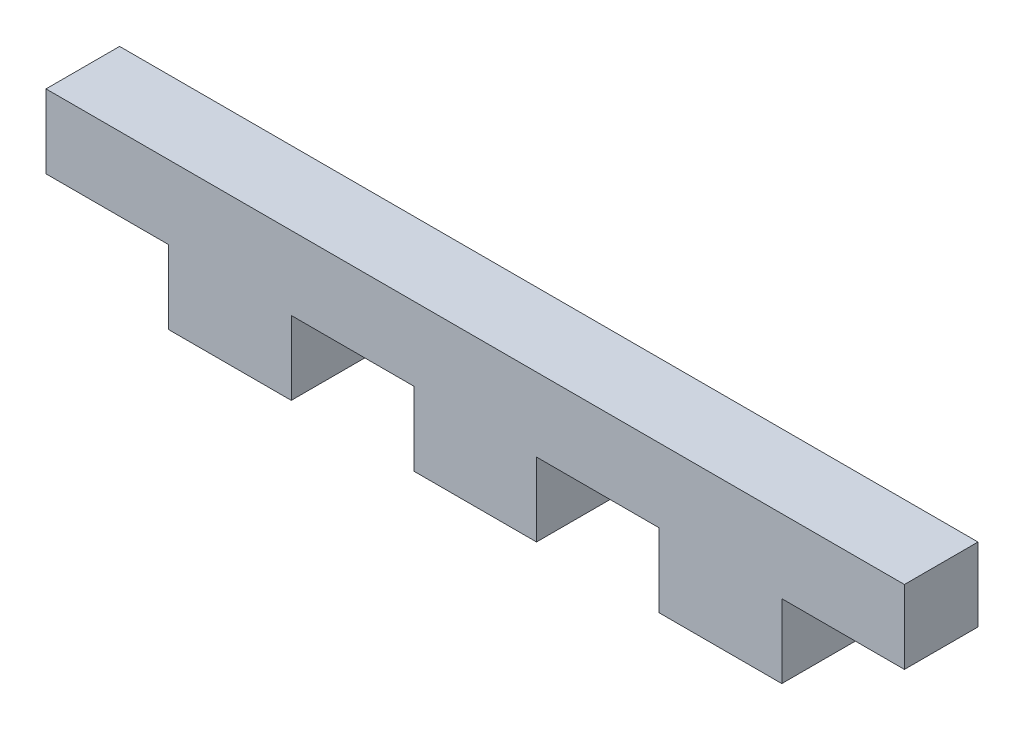
ISO-10303-21;
HEADER;
FILE_DESCRIPTION(('STEP AP214'),'2;1');
FILE_NAME('part.step','',(''),(''),'','','');
FILE_SCHEMA(('AUTOMOTIVE_DESIGN { 1 0 10303 214 1 1 1 1 }'));
ENDSEC;
DATA;
#1=APPLICATION_CONTEXT('core data for automotive mechanical design processes');
#2=APPLICATION_PROTOCOL_DEFINITION('international standard','automotive_design',2000,#1);
#3=PRODUCT_CONTEXT('',#1,'mechanical');
#4=PRODUCT('Part','Part','',(#3));
#5=PRODUCT_RELATED_PRODUCT_CATEGORY('part','',(#4));
#6=PRODUCT_DEFINITION_FORMATION('','',#4);
#7=PRODUCT_DEFINITION_CONTEXT('part definition',#1,'design');
#8=PRODUCT_DEFINITION('design','',#6,#7);
#9=PRODUCT_DEFINITION_SHAPE('','',#8);
#10=(LENGTH_UNIT() NAMED_UNIT(*) SI_UNIT(.MILLI.,.METRE.));
#11=(NAMED_UNIT(*) PLANE_ANGLE_UNIT() SI_UNIT($,.RADIAN.));
#12=(NAMED_UNIT(*) SI_UNIT($,.STERADIAN.) SOLID_ANGLE_UNIT());
#13=UNCERTAINTY_MEASURE_WITH_UNIT(LENGTH_MEASURE(1.E-05),#10,'distance_accuracy_value','');
#14=(GEOMETRIC_REPRESENTATION_CONTEXT(3) GLOBAL_UNCERTAINTY_ASSIGNED_CONTEXT((#13)) GLOBAL_UNIT_ASSIGNED_CONTEXT((#10,
#11,#12)) REPRESENTATION_CONTEXT('',''));
#15=CARTESIAN_POINT('',(0.,0.,0.));
#16=DIRECTION('',(0.,0.,1.));
#17=DIRECTION('',(1.,0.,0.));
#18=AXIS2_PLACEMENT_3D('',#15,#16,#17);
#19=CARTESIAN_POINT('',(8.99010664219347,0.,3.));
#20=DIRECTION('',(1.,0.,0.));
#21=DIRECTION('',(0.,1.,0.));
#22=AXIS2_PLACEMENT_3D('',#19,#20,#21);
#23=PLANE('',#22);
#24=DIRECTION('',(0.,-1.,0.));
#25=VECTOR('',#24,1.);
#26=CARTESIAN_POINT('',(8.99010664219347,0.,0.));
#27=LINE('',#26,#25);
#28=CARTESIAN_POINT('',(8.99010664219347,0.100430327009229,0.));
#29=VERTEX_POINT('',#28);
#30=CARTESIAN_POINT('',(8.99010664219347,-2.89956967299077,0.));
#31=VERTEX_POINT('',#30);
#32=EDGE_CURVE('E208',#29,#31,#27,.T.);
#33=ORIENTED_EDGE('',*,*,#32,.F.);
#34=DIRECTION('',(0.,0.,-1.));
#35=VECTOR('',#34,1.);
#36=CARTESIAN_POINT('',(8.99010664219347,0.100430327009229,3.));
#37=LINE('',#36,#35);
#38=CARTESIAN_POINT('',(8.99010664219347,0.100430327009229,3.));
#39=VERTEX_POINT('',#38);
#40=EDGE_CURVE('E11',#39,#29,#37,.T.);
#41=ORIENTED_EDGE('',*,*,#40,.F.);
#42=DIRECTION('',(0.,-1.,0.));
#43=VECTOR('',#42,1.);
#44=CARTESIAN_POINT('',(8.99010664219347,0.,3.));
#45=LINE('',#44,#43);
#46=CARTESIAN_POINT('',(8.99010664219347,-2.89956967299077,3.));
#47=VERTEX_POINT('',#46);
#48=EDGE_CURVE('E183',#39,#47,#45,.T.);
#49=ORIENTED_EDGE('',*,*,#48,.T.);
#50=DIRECTION('',(0.,0.,-1.));
#51=VECTOR('',#50,1.);
#52=CARTESIAN_POINT('',(8.99010664219347,-2.89956967299077,3.));
#53=LINE('',#52,#51);
#54=EDGE_CURVE('E109',#47,#31,#53,.T.);
#55=ORIENTED_EDGE('',*,*,#54,.T.);
#56=EDGE_LOOP('',(#33,#41,#49,#55));
#57=FACE_BOUND('',#56,.T.);
#58=ADVANCED_FACE('F35',(#57),#23,.T.);
#59=CARTESIAN_POINT('',(0.,0.10043032700923,3.));
#60=DIRECTION('',(0.,-1.,0.));
#61=DIRECTION('',(1.,0.,0.));
#62=AXIS2_PLACEMENT_3D('',#59,#60,#61);
#63=PLANE('',#62);
#64=DIRECTION('',(-1.,0.,0.));
#65=VECTOR('',#64,1.);
#66=CARTESIAN_POINT('',(0.,0.10043032700923,0.));
#67=LINE('',#66,#65);
#68=CARTESIAN_POINT('',(13.9901066421935,0.100430327009228,0.));
#69=VERTEX_POINT('',#68);
#70=EDGE_CURVE('E211',#69,#29,#67,.T.);
#71=ORIENTED_EDGE('',*,*,#70,.F.);
#72=DIRECTION('',(0.,0.,-1.));
#73=VECTOR('',#72,1.);
#74=CARTESIAN_POINT('',(13.9901066421935,0.100430327009228,3.));
#75=LINE('',#74,#73);
#76=CARTESIAN_POINT('',(13.9901066421935,0.100430327009228,3.));
#77=VERTEX_POINT('',#76);
#78=EDGE_CURVE('E43',#77,#69,#75,.T.);
#79=ORIENTED_EDGE('',*,*,#78,.F.);
#80=DIRECTION('',(-1.,0.,0.));
#81=VECTOR('',#80,1.);
#82=CARTESIAN_POINT('',(0.,0.10043032700923,3.));
#83=LINE('',#82,#81);
#84=EDGE_CURVE('E172',#77,#39,#83,.T.);
#85=ORIENTED_EDGE('',*,*,#84,.T.);
#86=ORIENTED_EDGE('',*,*,#40,.T.);
#87=EDGE_LOOP('',(#71,#79,#85,#86));
#88=FACE_BOUND('',#87,.T.);
#89=ADVANCED_FACE('F276',(#88),#63,.T.);
#90=CARTESIAN_POINT('',(13.9901066421935,0.,3.));
#91=DIRECTION('',(1.,0.,0.));
#92=DIRECTION('',(0.,0.,-1.));
#93=AXIS2_PLACEMENT_3D('',#90,#91,#92);
#94=PLANE('',#93);
#95=DIRECTION('',(0.,-1.,0.));
#96=VECTOR('',#95,1.);
#97=CARTESIAN_POINT('',(13.9901066421935,0.,0.));
#98=LINE('',#97,#96);
#99=CARTESIAN_POINT('',(13.9901066421935,-2.89956967299077,0.));
#100=VERTEX_POINT('',#99);
#101=EDGE_CURVE('E214',#69,#100,#98,.T.);
#102=ORIENTED_EDGE('',*,*,#101,.T.);
#103=DIRECTION('',(0.,0.,-1.));
#104=VECTOR('',#103,1.);
#105=CARTESIAN_POINT('',(13.9901066421935,-2.89956967299077,3.));
#106=LINE('',#105,#104);
#107=CARTESIAN_POINT('',(13.9901066421935,-2.89956967299077,3.));
#108=VERTEX_POINT('',#107);
#109=EDGE_CURVE('E265',#108,#100,#106,.T.);
#110=ORIENTED_EDGE('',*,*,#109,.F.);
#111=DIRECTION('',(0.,-1.,0.));
#112=VECTOR('',#111,1.);
#113=CARTESIAN_POINT('',(13.9901066421935,0.,3.));
#114=LINE('',#113,#112);
#115=EDGE_CURVE('E182',#77,#108,#114,.T.);
#116=ORIENTED_EDGE('',*,*,#115,.F.);
#117=ORIENTED_EDGE('',*,*,#78,.T.);
#118=EDGE_LOOP('',(#102,#110,#116,#117));
#119=FACE_BOUND('',#118,.T.);
#120=ADVANCED_FACE('F270',(#119),#94,.F.);
#121=CARTESIAN_POINT('',(0.,-2.89956967299077,3.));
#122=DIRECTION('',(0.,1.,0.));
#123=DIRECTION('',(-1.,0.,0.));
#124=AXIS2_PLACEMENT_3D('',#121,#122,#123);
#125=PLANE('',#124);
#126=DIRECTION('',(1.,0.,0.));
#127=VECTOR('',#126,1.);
#128=CARTESIAN_POINT('',(0.,-2.89956967299077,0.));
#129=LINE('',#128,#127);
#130=CARTESIAN_POINT('',(18.9901066421935,-2.89956967299077,0.));
#131=VERTEX_POINT('',#130);
#132=EDGE_CURVE('E217',#100,#131,#129,.T.);
#133=ORIENTED_EDGE('',*,*,#132,.T.);
#134=DIRECTION('',(0.,0.,-1.));
#135=VECTOR('',#134,1.);
#136=CARTESIAN_POINT('',(18.9901066421935,-2.89956967299077,3.));
#137=LINE('',#136,#135);
#138=CARTESIAN_POINT('',(18.9901066421935,-2.89956967299077,3.));
#139=VERTEX_POINT('',#138);
#140=EDGE_CURVE('E263',#139,#131,#137,.T.);
#141=ORIENTED_EDGE('',*,*,#140,.F.);
#142=DIRECTION('',(1.,0.,0.));
#143=VECTOR('',#142,1.);
#144=CARTESIAN_POINT('',(0.,-2.89956967299077,3.));
#145=LINE('',#144,#143);
#146=EDGE_CURVE('E186',#108,#139,#145,.T.);
#147=ORIENTED_EDGE('',*,*,#146,.F.);
#148=ORIENTED_EDGE('',*,*,#109,.T.);
#149=EDGE_LOOP('',(#133,#141,#147,#148));
#150=FACE_BOUND('',#149,.T.);
#151=ADVANCED_FACE('F283',(#150),#125,.F.);
#152=CARTESIAN_POINT('',(18.9901066421935,0.,3.));
#153=DIRECTION('',(1.,0.,0.));
#154=DIRECTION('',(0.,1.,0.));
#155=AXIS2_PLACEMENT_3D('',#152,#153,#154);
#156=PLANE('',#155);
#157=DIRECTION('',(0.,-1.,0.));
#158=VECTOR('',#157,1.);
#159=CARTESIAN_POINT('',(18.9901066421935,0.,0.));
#160=LINE('',#159,#158);
#161=CARTESIAN_POINT('',(18.9901066421935,0.100430327009225,0.));
#162=VERTEX_POINT('',#161);
#163=EDGE_CURVE('E220',#162,#131,#160,.T.);
#164=ORIENTED_EDGE('',*,*,#163,.F.);
#165=DIRECTION('',(0.,0.,-1.));
#166=VECTOR('',#165,1.);
#167=CARTESIAN_POINT('',(18.9901066421935,0.100430327009225,3.));
#168=LINE('',#167,#166);
#169=CARTESIAN_POINT('',(18.9901066421935,0.100430327009225,3.));
#170=VERTEX_POINT('',#169);
#171=EDGE_CURVE('E261',#170,#162,#168,.T.);
#172=ORIENTED_EDGE('',*,*,#171,.F.);
#173=DIRECTION('',(0.,-1.,0.));
#174=VECTOR('',#173,1.);
#175=CARTESIAN_POINT('',(18.9901066421935,0.,3.));
#176=LINE('',#175,#174);
#177=EDGE_CURVE('E190',#170,#139,#176,.T.);
#178=ORIENTED_EDGE('',*,*,#177,.T.);
#179=ORIENTED_EDGE('',*,*,#140,.T.);
#180=EDGE_LOOP('',(#164,#172,#178,#179));
#181=FACE_BOUND('',#180,.T.);
#182=ADVANCED_FACE('F285',(#181),#156,.T.);
#183=CARTESIAN_POINT('',(23.9901066421935,0.100430327009223,0.));
#184=VERTEX_POINT('',#183);
#185=EDGE_CURVE('E215',#184,#162,#67,.T.);
#186=ORIENTED_EDGE('',*,*,#185,.F.);
#187=DIRECTION('',(0.,0.,-1.));
#188=VECTOR('',#187,1.);
#189=CARTESIAN_POINT('',(23.9901066421935,0.100430327009223,3.));
#190=LINE('',#189,#188);
#191=CARTESIAN_POINT('',(23.9901066421935,0.100430327009223,3.));
#192=VERTEX_POINT('',#191);
#193=EDGE_CURVE('E259',#192,#184,#190,.T.);
#194=ORIENTED_EDGE('',*,*,#193,.F.);
#195=EDGE_CURVE('E180',#192,#170,#83,.T.);
#196=ORIENTED_EDGE('',*,*,#195,.T.);
#197=ORIENTED_EDGE('',*,*,#171,.T.);
#198=EDGE_LOOP('',(#186,#194,#196,#197));
#199=FACE_BOUND('',#198,.T.);
#200=ADVANCED_FACE('F319',(#199),#63,.T.);
#201=CARTESIAN_POINT('',(23.9901066421935,0.,3.));
#202=DIRECTION('',(1.,0.,0.));
#203=DIRECTION('',(0.,0.,-1.));
#204=AXIS2_PLACEMENT_3D('',#201,#202,#203);
#205=PLANE('',#204);
#206=DIRECTION('',(0.,-1.,0.));
#207=VECTOR('',#206,1.);
#208=CARTESIAN_POINT('',(23.9901066421935,0.,0.));
#209=LINE('',#208,#207);
#210=CARTESIAN_POINT('',(23.9901066421935,-2.89956967299077,0.));
#211=VERTEX_POINT('',#210);
#212=EDGE_CURVE('E223',#184,#211,#209,.T.);
#213=ORIENTED_EDGE('',*,*,#212,.T.);
#214=DIRECTION('',(0.,0.,-1.));
#215=VECTOR('',#214,1.);
#216=CARTESIAN_POINT('',(23.9901066421935,-2.89956967299077,3.));
#217=LINE('',#216,#215);
#218=CARTESIAN_POINT('',(23.9901066421935,-2.89956967299077,3.));
#219=VERTEX_POINT('',#218);
#220=EDGE_CURVE('E256',#219,#211,#217,.T.);
#221=ORIENTED_EDGE('',*,*,#220,.F.);
#222=DIRECTION('',(0.,-1.,0.));
#223=VECTOR('',#222,1.);
#224=CARTESIAN_POINT('',(23.9901066421935,0.,3.));
#225=LINE('',#224,#223);
#226=EDGE_CURVE('E189',#192,#219,#225,.T.);
#227=ORIENTED_EDGE('',*,*,#226,.F.);
#228=ORIENTED_EDGE('',*,*,#193,.T.);
#229=EDGE_LOOP('',(#213,#221,#227,#228));
#230=FACE_BOUND('',#229,.T.);
#231=ADVANCED_FACE('F318',(#230),#205,.F.);
#232=CARTESIAN_POINT('',(0.,-2.89956967299077,3.));
#233=DIRECTION('',(0.,1.,0.));
#234=DIRECTION('',(-1.,0.,0.));
#235=AXIS2_PLACEMENT_3D('',#232,#233,#234);
#236=PLANE('',#235);
#237=DIRECTION('',(1.,0.,0.));
#238=VECTOR('',#237,1.);
#239=CARTESIAN_POINT('',(0.,-2.89956967299077,0.));
#240=LINE('',#239,#238);
#241=CARTESIAN_POINT('',(28.9901066421935,-2.89956967299077,0.));
#242=VERTEX_POINT('',#241);
#243=EDGE_CURVE('E225',#211,#242,#240,.T.);
#244=ORIENTED_EDGE('',*,*,#243,.T.);
#245=DIRECTION('',(0.,0.,-1.));
#246=VECTOR('',#245,1.);
#247=CARTESIAN_POINT('',(28.9901066421935,-2.89956967299077,3.));
#248=LINE('',#247,#246);
#249=CARTESIAN_POINT('',(28.9901066421935,-2.89956967299077,3.));
#250=VERTEX_POINT('',#249);
#251=EDGE_CURVE('E254',#250,#242,#248,.T.);
#252=ORIENTED_EDGE('',*,*,#251,.F.);
#253=DIRECTION('',(1.,0.,0.));
#254=VECTOR('',#253,1.);
#255=CARTESIAN_POINT('',(0.,-2.89956967299077,3.));
#256=LINE('',#255,#254);
#257=EDGE_CURVE('E193',#219,#250,#256,.T.);
#258=ORIENTED_EDGE('',*,*,#257,.F.);
#259=ORIENTED_EDGE('',*,*,#220,.T.);
#260=EDGE_LOOP('',(#244,#252,#258,#259));
#261=FACE_BOUND('',#260,.T.);
#262=ADVANCED_FACE('F313',(#261),#236,.F.);
#263=CARTESIAN_POINT('',(28.9901066421935,0.,3.));
#264=DIRECTION('',(1.,0.,0.));
#265=DIRECTION('',(0.,0.,-1.));
#266=AXIS2_PLACEMENT_3D('',#263,#264,#265);
#267=PLANE('',#266);
#268=DIRECTION('',(0.,-1.,0.));
#269=VECTOR('',#268,1.);
#270=CARTESIAN_POINT('',(28.9901066421935,0.,0.));
#271=LINE('',#270,#269);
#272=CARTESIAN_POINT('',(28.9901066421935,0.100430327009222,0.));
#273=VERTEX_POINT('',#272);
#274=EDGE_CURVE('E228',#273,#242,#271,.T.);
#275=ORIENTED_EDGE('',*,*,#274,.F.);
#276=DIRECTION('',(0.,0.,-1.));
#277=VECTOR('',#276,1.);
#278=CARTESIAN_POINT('',(28.9901066421935,0.100430327009222,3.));
#279=LINE('',#278,#277);
#280=CARTESIAN_POINT('',(28.9901066421935,0.100430327009222,3.));
#281=VERTEX_POINT('',#280);
#282=EDGE_CURVE('E252',#281,#273,#279,.T.);
#283=ORIENTED_EDGE('',*,*,#282,.F.);
#284=DIRECTION('',(0.,-1.,0.));
#285=VECTOR('',#284,1.);
#286=CARTESIAN_POINT('',(28.9901066421935,0.,3.));
#287=LINE('',#286,#285);
#288=EDGE_CURVE('E179',#281,#250,#287,.T.);
#289=ORIENTED_EDGE('',*,*,#288,.T.);
#290=ORIENTED_EDGE('',*,*,#251,.T.);
#291=EDGE_LOOP('',(#275,#283,#289,#290));
#292=FACE_BOUND('',#291,.T.);
#293=ADVANCED_FACE('F310',(#292),#267,.T.);
#294=CARTESIAN_POINT('',(33.9901066421935,0.10043032700922,0.));
#295=VERTEX_POINT('',#294);
#296=EDGE_CURVE('E231',#295,#273,#67,.T.);
#297=ORIENTED_EDGE('',*,*,#296,.F.);
#298=DIRECTION('',(0.,0.,-1.));
#299=VECTOR('',#298,1.);
#300=CARTESIAN_POINT('',(33.9901066421935,0.10043032700922,3.));
#301=LINE('',#300,#299);
#302=CARTESIAN_POINT('',(33.9901066421935,0.10043032700922,3.));
#303=VERTEX_POINT('',#302);
#304=EDGE_CURVE('E250',#303,#295,#301,.T.);
#305=ORIENTED_EDGE('',*,*,#304,.F.);
#306=EDGE_CURVE('E171',#303,#281,#83,.T.);
#307=ORIENTED_EDGE('',*,*,#306,.T.);
#308=ORIENTED_EDGE('',*,*,#282,.T.);
#309=EDGE_LOOP('',(#297,#305,#307,#308));
#310=FACE_BOUND('',#309,.T.);
#311=ADVANCED_FACE('F306',(#310),#63,.T.);
#312=CARTESIAN_POINT('',(33.9901066421935,0.,3.));
#313=DIRECTION('',(1.,0.,0.));
#314=DIRECTION('',(0.,0.,-1.));
#315=AXIS2_PLACEMENT_3D('',#312,#313,#314);
#316=PLANE('',#315);
#317=DIRECTION('',(0.,-1.,0.));
#318=VECTOR('',#317,1.);
#319=CARTESIAN_POINT('',(33.9901066421935,0.,0.));
#320=LINE('',#319,#318);
#321=CARTESIAN_POINT('',(33.9901066421935,3.10043032700922,0.));
#322=VERTEX_POINT('',#321);
#323=EDGE_CURVE('E232',#322,#295,#320,.T.);
#324=ORIENTED_EDGE('',*,*,#323,.F.);
#325=DIRECTION('',(0.,0.,-1.));
#326=VECTOR('',#325,1.);
#327=CARTESIAN_POINT('',(33.9901066421935,3.10043032700922,3.));
#328=LINE('',#327,#326);
#329=CARTESIAN_POINT('',(33.9901066421935,3.10043032700922,3.));
#330=VERTEX_POINT('',#329);
#331=EDGE_CURVE('E248',#330,#322,#328,.T.);
#332=ORIENTED_EDGE('',*,*,#331,.F.);
#333=DIRECTION('',(0.,-1.,0.));
#334=VECTOR('',#333,1.);
#335=CARTESIAN_POINT('',(33.9901066421935,0.,3.));
#336=LINE('',#335,#334);
#337=EDGE_CURVE('E178',#330,#303,#336,.T.);
#338=ORIENTED_EDGE('',*,*,#337,.T.);
#339=ORIENTED_EDGE('',*,*,#304,.T.);
#340=EDGE_LOOP('',(#324,#332,#338,#339));
#341=FACE_BOUND('',#340,.T.);
#342=ADVANCED_FACE('F303',(#341),#316,.T.);
#343=CARTESIAN_POINT('',(0.,3.10043032700923,3.));
#344=DIRECTION('',(0.,-1.,0.));
#345=DIRECTION('',(1.,0.,0.));
#346=AXIS2_PLACEMENT_3D('',#343,#344,#345);
#347=PLANE('',#346);
#348=DIRECTION('',(-1.,0.,0.));
#349=VECTOR('',#348,1.);
#350=CARTESIAN_POINT('',(0.,3.10043032700923,0.));
#351=LINE('',#350,#349);
#352=CARTESIAN_POINT('',(-1.00989335780653,3.10043032700923,0.));
#353=VERTEX_POINT('',#352);
#354=EDGE_CURVE('E235',#322,#353,#351,.T.);
#355=ORIENTED_EDGE('',*,*,#354,.T.);
#356=DIRECTION('',(0.,0.,-1.));
#357=VECTOR('',#356,1.);
#358=CARTESIAN_POINT('',(-1.00989335780653,3.10043032700923,3.));
#359=LINE('',#358,#357);
#360=CARTESIAN_POINT('',(-1.00989335780653,3.10043032700923,3.));
#361=VERTEX_POINT('',#360);
#362=EDGE_CURVE('E245',#361,#353,#359,.T.);
#363=ORIENTED_EDGE('',*,*,#362,.F.);
#364=DIRECTION('',(-1.,0.,0.));
#365=VECTOR('',#364,1.);
#366=CARTESIAN_POINT('',(0.,3.10043032700923,3.));
#367=LINE('',#366,#365);
#368=EDGE_CURVE('E173',#330,#361,#367,.T.);
#369=ORIENTED_EDGE('',*,*,#368,.F.);
#370=ORIENTED_EDGE('',*,*,#331,.T.);
#371=EDGE_LOOP('',(#355,#363,#369,#370));
#372=FACE_BOUND('',#371,.T.);
#373=ADVANCED_FACE('F300',(#372),#347,.F.);
#374=CARTESIAN_POINT('',(-1.00989335780653,0.,3.));
#375=DIRECTION('',(1.,0.,0.));
#376=DIRECTION('',(0.,1.,0.));
#377=AXIS2_PLACEMENT_3D('',#374,#375,#376);
#378=PLANE('',#377);
#379=DIRECTION('',(0.,-1.,0.));
#380=VECTOR('',#379,1.);
#381=CARTESIAN_POINT('',(-1.00989335780653,0.,0.));
#382=LINE('',#381,#380);
#383=CARTESIAN_POINT('',(-1.00989335780653,0.10043032700923,0.));
#384=VERTEX_POINT('',#383);
#385=EDGE_CURVE('E237',#353,#384,#382,.T.);
#386=ORIENTED_EDGE('',*,*,#385,.T.);
#387=DIRECTION('',(0.,0.,-1.));
#388=VECTOR('',#387,1.);
#389=CARTESIAN_POINT('',(-1.00989335780653,0.10043032700923,3.));
#390=LINE('',#389,#388);
#391=CARTESIAN_POINT('',(-1.00989335780653,0.10043032700923,3.));
#392=VERTEX_POINT('',#391);
#393=EDGE_CURVE('E160',#392,#384,#390,.T.);
#394=ORIENTED_EDGE('',*,*,#393,.F.);
#395=DIRECTION('',(0.,-1.,0.));
#396=VECTOR('',#395,1.);
#397=CARTESIAN_POINT('',(-1.00989335780653,0.,3.));
#398=LINE('',#397,#396);
#399=EDGE_CURVE('E168',#361,#392,#398,.T.);
#400=ORIENTED_EDGE('',*,*,#399,.F.);
#401=ORIENTED_EDGE('',*,*,#362,.T.);
#402=EDGE_LOOP('',(#386,#394,#400,#401));
#403=FACE_BOUND('',#402,.T.);
#404=ADVANCED_FACE('F296',(#403),#378,.F.);
#405=CARTESIAN_POINT('',(3.99010664219347,0.10043032700923,0.));
#406=VERTEX_POINT('',#405);
#407=EDGE_CURVE('E159',#406,#384,#67,.T.);
#408=ORIENTED_EDGE('',*,*,#407,.F.);
#409=DIRECTION('',(0.,0.,-1.));
#410=VECTOR('',#409,1.);
#411=CARTESIAN_POINT('',(3.99010664219347,0.10043032700923,3.));
#412=LINE('',#411,#410);
#413=CARTESIAN_POINT('',(3.99010664219347,0.10043032700923,3.));
#414=VERTEX_POINT('',#413);
#415=EDGE_CURVE('E153',#414,#406,#412,.T.);
#416=ORIENTED_EDGE('',*,*,#415,.F.);
#417=EDGE_CURVE('E157',#414,#392,#83,.T.);
#418=ORIENTED_EDGE('',*,*,#417,.T.);
#419=ORIENTED_EDGE('',*,*,#393,.T.);
#420=EDGE_LOOP('',(#408,#416,#418,#419));
#421=FACE_BOUND('',#420,.T.);
#422=ADVANCED_FACE('F155',(#421),#63,.T.);
#423=CARTESIAN_POINT('',(3.99010664219347,0.,3.));
#424=DIRECTION('',(1.,0.,0.));
#425=DIRECTION('',(0.,1.,0.));
#426=AXIS2_PLACEMENT_3D('',#423,#424,#425);
#427=PLANE('',#426);
#428=DIRECTION('',(0.,-1.,0.));
#429=VECTOR('',#428,1.);
#430=CARTESIAN_POINT('',(3.99010664219347,0.,0.));
#431=LINE('',#430,#429);
#432=CARTESIAN_POINT('',(3.99010664219347,-2.89956967299077,0.));
#433=VERTEX_POINT('',#432);
#434=EDGE_CURVE('E102',#406,#433,#431,.T.);
#435=ORIENTED_EDGE('',*,*,#434,.T.);
#436=DIRECTION('',(0.,0.,-1.));
#437=VECTOR('',#436,1.);
#438=CARTESIAN_POINT('',(3.99010664219347,-2.89956967299077,3.));
#439=LINE('',#438,#437);
#440=CARTESIAN_POINT('',(3.99010664219347,-2.89956967299077,3.));
#441=VERTEX_POINT('',#440);
#442=EDGE_CURVE('E161',#441,#433,#439,.T.);
#443=ORIENTED_EDGE('',*,*,#442,.F.);
#444=DIRECTION('',(0.,-1.,0.));
#445=VECTOR('',#444,1.);
#446=CARTESIAN_POINT('',(3.99010664219347,0.,3.));
#447=LINE('',#446,#445);
#448=EDGE_CURVE('E163',#414,#441,#447,.T.);
#449=ORIENTED_EDGE('',*,*,#448,.F.);
#450=ORIENTED_EDGE('',*,*,#415,.T.);
#451=EDGE_LOOP('',(#435,#443,#449,#450));
#452=FACE_BOUND('',#451,.T.);
#453=ADVANCED_FACE('F164',(#452),#427,.F.);
#454=CARTESIAN_POINT('',(0.,-2.89956967299077,3.));
#455=DIRECTION('',(0.,1.,0.));
#456=DIRECTION('',(-1.,0.,0.));
#457=AXIS2_PLACEMENT_3D('',#454,#455,#456);
#458=PLANE('',#457);
#459=DIRECTION('',(1.,0.,0.));
#460=VECTOR('',#459,1.);
#461=CARTESIAN_POINT('',(0.,-2.89956967299077,0.));
#462=LINE('',#461,#460);
#463=EDGE_CURVE('E187',#433,#31,#462,.T.);
#464=ORIENTED_EDGE('',*,*,#463,.T.);
#465=ORIENTED_EDGE('',*,*,#54,.F.);
#466=DIRECTION('',(1.,0.,0.));
#467=VECTOR('',#466,1.);
#468=CARTESIAN_POINT('',(0.,-2.89956967299077,3.));
#469=LINE('',#468,#467);
#470=EDGE_CURVE('E51',#441,#47,#469,.T.);
#471=ORIENTED_EDGE('',*,*,#470,.F.);
#472=ORIENTED_EDGE('',*,*,#442,.T.);
#473=EDGE_LOOP('',(#464,#465,#471,#472));
#474=FACE_BOUND('',#473,.T.);
#475=ADVANCED_FACE('F279',(#474),#458,.F.);
#476=CARTESIAN_POINT('',(0.,0.,3.));
#477=DIRECTION('',(0.,0.,1.));
#478=DIRECTION('',(1.,0.,0.));
#479=AXIS2_PLACEMENT_3D('',#476,#477,#478);
#480=PLANE('',#479);
#481=ORIENTED_EDGE('',*,*,#48,.F.);
#482=ORIENTED_EDGE('',*,*,#84,.F.);
#483=ORIENTED_EDGE('',*,*,#115,.T.);
#484=ORIENTED_EDGE('',*,*,#146,.T.);
#485=ORIENTED_EDGE('',*,*,#177,.F.);
#486=ORIENTED_EDGE('',*,*,#195,.F.);
#487=ORIENTED_EDGE('',*,*,#226,.T.);
#488=ORIENTED_EDGE('',*,*,#257,.T.);
#489=ORIENTED_EDGE('',*,*,#288,.F.);
#490=ORIENTED_EDGE('',*,*,#306,.F.);
#491=ORIENTED_EDGE('',*,*,#337,.F.);
#492=ORIENTED_EDGE('',*,*,#368,.T.);
#493=ORIENTED_EDGE('',*,*,#399,.T.);
#494=ORIENTED_EDGE('',*,*,#417,.F.);
#495=ORIENTED_EDGE('',*,*,#448,.T.);
#496=ORIENTED_EDGE('',*,*,#470,.T.);
#497=EDGE_LOOP('',(#481,#482,#483,#484,#485,#486,#487,#488,#489,#490,#491,#492,#493,#494,#495,#496));
#498=FACE_BOUND('',#497,.T.);
#499=ADVANCED_FACE('F166',(#498),#480,.T.);
#500=CARTESIAN_POINT('',(0.,0.,0.));
#501=DIRECTION('',(0.,0.,1.));
#502=DIRECTION('',(1.,0.,0.));
#503=AXIS2_PLACEMENT_3D('',#500,#501,#502);
#504=PLANE('',#503);
#505=ORIENTED_EDGE('',*,*,#32,.T.);
#506=ORIENTED_EDGE('',*,*,#463,.F.);
#507=ORIENTED_EDGE('',*,*,#434,.F.);
#508=ORIENTED_EDGE('',*,*,#407,.T.);
#509=ORIENTED_EDGE('',*,*,#385,.F.);
#510=ORIENTED_EDGE('',*,*,#354,.F.);
#511=ORIENTED_EDGE('',*,*,#323,.T.);
#512=ORIENTED_EDGE('',*,*,#296,.T.);
#513=ORIENTED_EDGE('',*,*,#274,.T.);
#514=ORIENTED_EDGE('',*,*,#243,.F.);
#515=ORIENTED_EDGE('',*,*,#212,.F.);
#516=ORIENTED_EDGE('',*,*,#185,.T.);
#517=ORIENTED_EDGE('',*,*,#163,.T.);
#518=ORIENTED_EDGE('',*,*,#132,.F.);
#519=ORIENTED_EDGE('',*,*,#101,.F.);
#520=ORIENTED_EDGE('',*,*,#70,.T.);
#521=EDGE_LOOP('',(#505,#506,#507,#508,#509,#510,#511,#512,#513,#514,#515,#516,#517,#518,#519,#520));
#522=FACE_BOUND('',#521,.T.);
#523=ADVANCED_FACE('F275',(#522),#504,.F.);
#524=CLOSED_SHELL('',(#58,#89,#120,#151,#182,#200,#231,#262,#293,#311,#342,#373,#404,#422,#453,
#475,#499,#523));
#525=MANIFOLD_SOLID_BREP('B2',#524);
#526=ADVANCED_BREP_SHAPE_REPRESENTATION('',(#18,#525),#14);
#527=SHAPE_DEFINITION_REPRESENTATION(#9,#526);
ENDSEC;
END-ISO-10303-21;
